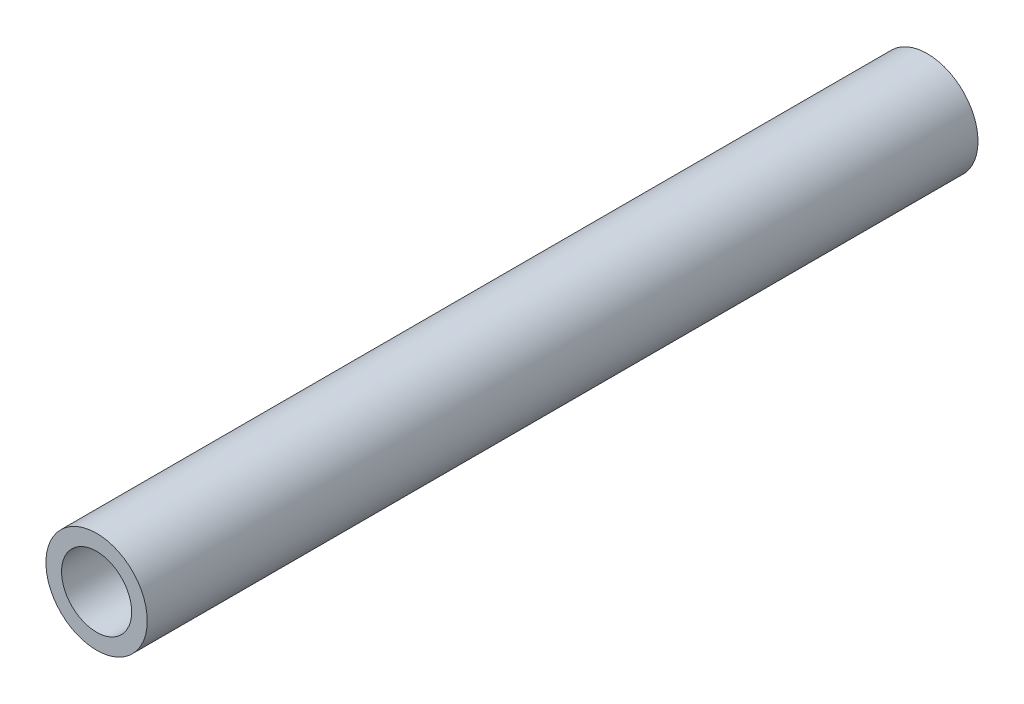
ISO-10303-21;
HEADER;
FILE_DESCRIPTION(('STEP AP214'),'2;1');
FILE_NAME('part.step','',(''),(''),'','','');
FILE_SCHEMA(('AUTOMOTIVE_DESIGN { 1 0 10303 214 1 1 1 1 }'));
ENDSEC;
DATA;
#1=APPLICATION_CONTEXT('core data for automotive mechanical design processes');
#2=APPLICATION_PROTOCOL_DEFINITION('international standard','automotive_design',2000,#1);
#3=PRODUCT_CONTEXT('',#1,'mechanical');
#4=PRODUCT('Part','Part','',(#3));
#5=PRODUCT_RELATED_PRODUCT_CATEGORY('part','',(#4));
#6=PRODUCT_DEFINITION_FORMATION('','',#4);
#7=PRODUCT_DEFINITION_CONTEXT('part definition',#1,'design');
#8=PRODUCT_DEFINITION('design','',#6,#7);
#9=PRODUCT_DEFINITION_SHAPE('','',#8);
#10=(LENGTH_UNIT() NAMED_UNIT(*) SI_UNIT(.MILLI.,.METRE.));
#11=(NAMED_UNIT(*) PLANE_ANGLE_UNIT() SI_UNIT($,.RADIAN.));
#12=(NAMED_UNIT(*) SI_UNIT($,.STERADIAN.) SOLID_ANGLE_UNIT());
#13=UNCERTAINTY_MEASURE_WITH_UNIT(LENGTH_MEASURE(1.E-05),#10,'distance_accuracy_value','');
#14=(GEOMETRIC_REPRESENTATION_CONTEXT(3) GLOBAL_UNCERTAINTY_ASSIGNED_CONTEXT((#13)) GLOBAL_UNIT_ASSIGNED_CONTEXT((#10,
#11,#12)) REPRESENTATION_CONTEXT('',''));
#15=CARTESIAN_POINT('',(0.,0.,0.));
#16=DIRECTION('',(0.,0.,1.));
#17=DIRECTION('',(1.,0.,0.));
#18=AXIS2_PLACEMENT_3D('',#15,#16,#17);
#19=CARTESIAN_POINT('',(0.,0.,127.));
#20=DIRECTION('',(0.,0.,1.));
#21=DIRECTION('',(1.,0.,0.));
#22=AXIS2_PLACEMENT_3D('',#19,#20,#21);
#23=PLANE('',#22);
#24=CARTESIAN_POINT('',(0.,0.,127.));
#25=DIRECTION('',(0.,0.,1.));
#26=DIRECTION('',(1.,0.,0.));
#27=AXIS2_PLACEMENT_3D('',#24,#25,#26);
#28=CIRCLE('',#27,7.747);
#29=CARTESIAN_POINT('',(7.747,0.,127.));
#30=VERTEX_POINT('',#29);
#31=EDGE_CURVE('E10',#30,#30,#28,.T.);
#32=ORIENTED_EDGE('',*,*,#31,.T.);
#33=EDGE_LOOP('',(#32));
#34=FACE_BOUND('',#33,.T.);
#35=CARTESIAN_POINT('',(0.,0.,127.));
#36=DIRECTION('',(0.,0.,1.));
#37=DIRECTION('',(1.,0.,0.));
#38=AXIS2_PLACEMENT_3D('',#35,#36,#37);
#39=CIRCLE('',#38,5.3594);
#40=CARTESIAN_POINT('',(5.3594,0.,127.));
#41=VERTEX_POINT('',#40);
#42=EDGE_CURVE('E41',#41,#41,#39,.T.);
#43=ORIENTED_EDGE('',*,*,#42,.F.);
#44=EDGE_LOOP('',(#43));
#45=FACE_BOUND('',#44,.T.);
#46=ADVANCED_FACE('F30',(#34,#45),#23,.T.);
#47=CARTESIAN_POINT('',(0.,0.,0.));
#48=DIRECTION('',(0.,0.,1.));
#49=DIRECTION('',(1.,0.,0.));
#50=AXIS2_PLACEMENT_3D('',#47,#48,#49);
#51=PLANE('',#50);
#52=CARTESIAN_POINT('',(0.,0.,0.));
#53=DIRECTION('',(0.,0.,1.));
#54=DIRECTION('',(1.,0.,0.));
#55=AXIS2_PLACEMENT_3D('',#52,#53,#54);
#56=CIRCLE('',#55,7.747);
#57=CARTESIAN_POINT('',(7.747,0.,0.));
#58=VERTEX_POINT('',#57);
#59=EDGE_CURVE('E34',#58,#58,#56,.T.);
#60=ORIENTED_EDGE('',*,*,#59,.F.);
#61=EDGE_LOOP('',(#60));
#62=FACE_BOUND('',#61,.T.);
#63=CARTESIAN_POINT('',(0.,0.,0.));
#64=DIRECTION('',(0.,0.,1.));
#65=DIRECTION('',(1.,0.,0.));
#66=AXIS2_PLACEMENT_3D('',#63,#64,#65);
#67=CIRCLE('',#66,5.3594);
#68=CARTESIAN_POINT('',(5.3594,0.,0.));
#69=VERTEX_POINT('',#68);
#70=EDGE_CURVE('E43',#69,#69,#67,.T.);
#71=ORIENTED_EDGE('',*,*,#70,.T.);
#72=EDGE_LOOP('',(#71));
#73=FACE_BOUND('',#72,.T.);
#74=ADVANCED_FACE('F53',(#62,#73),#51,.F.);
#75=CARTESIAN_POINT('',(0.,0.,127.));
#76=DIRECTION('',(0.,0.,-1.));
#77=DIRECTION('',(-1.,0.,0.));
#78=AXIS2_PLACEMENT_3D('',#75,#76,#77);
#79=CYLINDRICAL_SURFACE('',#78,7.747);
#80=ORIENTED_EDGE('',*,*,#31,.F.);
#81=EDGE_LOOP('',(#80));
#82=FACE_BOUND('',#81,.T.);
#83=ORIENTED_EDGE('',*,*,#59,.T.);
#84=EDGE_LOOP('',(#83));
#85=FACE_BOUND('',#84,.T.);
#86=ADVANCED_FACE('F32',(#82,#85),#79,.T.);
#87=CARTESIAN_POINT('',(0.,0.,127.));
#88=DIRECTION('',(0.,0.,-1.));
#89=DIRECTION('',(-1.,0.,0.));
#90=AXIS2_PLACEMENT_3D('',#87,#88,#89);
#91=CYLINDRICAL_SURFACE('',#90,5.3594);
#92=ORIENTED_EDGE('',*,*,#42,.T.);
#93=EDGE_LOOP('',(#92));
#94=FACE_BOUND('',#93,.T.);
#95=ORIENTED_EDGE('',*,*,#70,.F.);
#96=EDGE_LOOP('',(#95));
#97=FACE_BOUND('',#96,.T.);
#98=ADVANCED_FACE('F49',(#94,#97),#91,.F.);
#99=CLOSED_SHELL('',(#46,#74,#86,#98));
#100=MANIFOLD_SOLID_BREP('B2',#99);
#101=ADVANCED_BREP_SHAPE_REPRESENTATION('',(#18,#100),#14);
#102=SHAPE_DEFINITION_REPRESENTATION(#9,#101);
ENDSEC;
END-ISO-10303-21;
